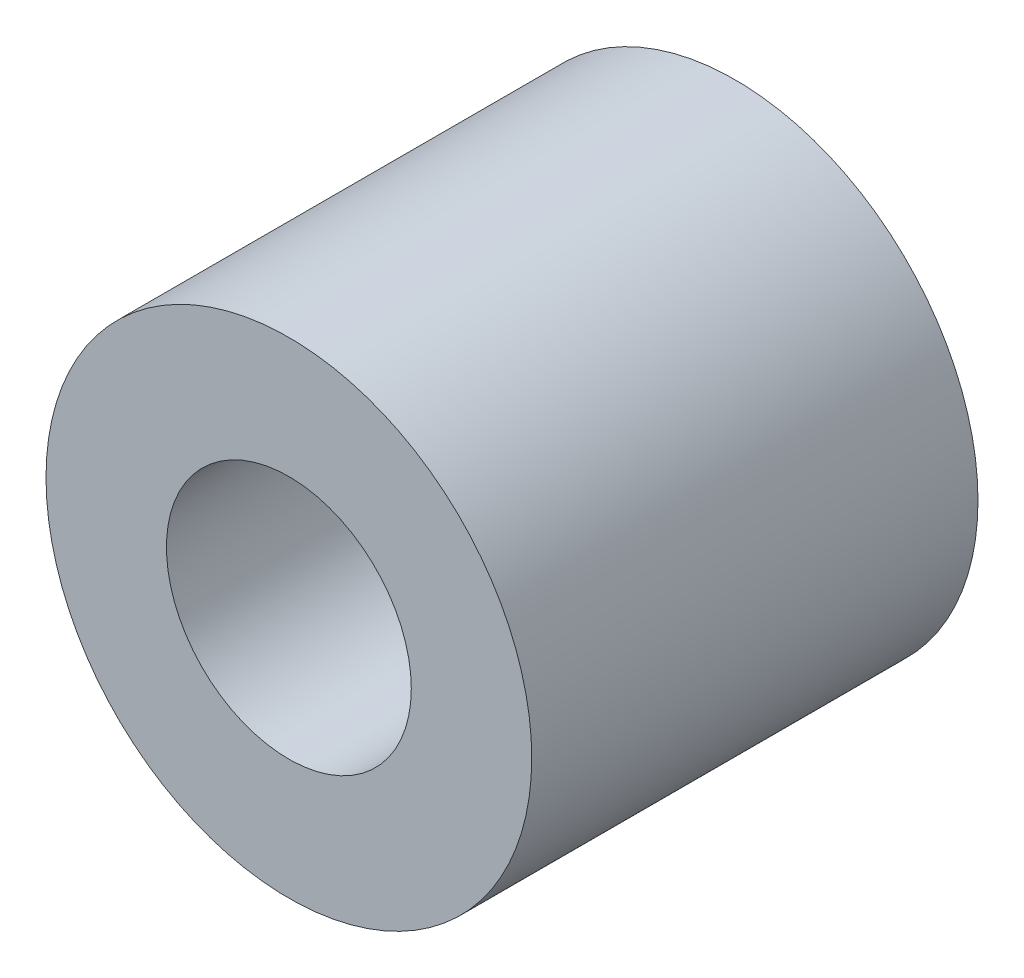
ISO-10303-21;
HEADER;
FILE_DESCRIPTION(('STEP AP214'),'2;1');
FILE_NAME('part.step','',(''),(''),'','','');
FILE_SCHEMA(('AUTOMOTIVE_DESIGN { 1 0 10303 214 1 1 1 1 }'));
ENDSEC;
DATA;
#1=APPLICATION_CONTEXT('core data for automotive mechanical design processes');
#2=APPLICATION_PROTOCOL_DEFINITION('international standard','automotive_design',2000,#1);
#3=PRODUCT_CONTEXT('',#1,'mechanical');
#4=PRODUCT('Part','Part','',(#3));
#5=PRODUCT_RELATED_PRODUCT_CATEGORY('part','',(#4));
#6=PRODUCT_DEFINITION_FORMATION('','',#4);
#7=PRODUCT_DEFINITION_CONTEXT('part definition',#1,'design');
#8=PRODUCT_DEFINITION('design','',#6,#7);
#9=PRODUCT_DEFINITION_SHAPE('','',#8);
#10=(LENGTH_UNIT() NAMED_UNIT(*) SI_UNIT(.MILLI.,.METRE.));
#11=(NAMED_UNIT(*) PLANE_ANGLE_UNIT() SI_UNIT($,.RADIAN.));
#12=(NAMED_UNIT(*) SI_UNIT($,.STERADIAN.) SOLID_ANGLE_UNIT());
#13=UNCERTAINTY_MEASURE_WITH_UNIT(LENGTH_MEASURE(1.E-05),#10,'distance_accuracy_value','');
#14=(GEOMETRIC_REPRESENTATION_CONTEXT(3) GLOBAL_UNCERTAINTY_ASSIGNED_CONTEXT((#13)) GLOBAL_UNIT_ASSIGNED_CONTEXT((#10,
#11,#12)) REPRESENTATION_CONTEXT('',''));
#15=CARTESIAN_POINT('',(0.,0.,0.));
#16=DIRECTION('',(0.,0.,1.));
#17=DIRECTION('',(1.,0.,0.));
#18=AXIS2_PLACEMENT_3D('',#15,#16,#17);
#19=CARTESIAN_POINT('',(0.,0.,5.7404));
#20=DIRECTION('',(0.,0.,1.));
#21=DIRECTION('',(1.,0.,0.));
#22=AXIS2_PLACEMENT_3D('',#19,#20,#21);
#23=PLANE('',#22);
#24=CARTESIAN_POINT('',(0.,0.,5.7404));
#25=DIRECTION('',(0.,0.,1.));
#26=DIRECTION('',(1.,0.,0.));
#27=AXIS2_PLACEMENT_3D('',#24,#25,#26);
#28=CIRCLE('',#27,3.1242);
#29=CARTESIAN_POINT('',(3.1242,0.,5.7404));
#30=VERTEX_POINT('',#29);
#31=EDGE_CURVE('E10',#30,#30,#28,.T.);
#32=ORIENTED_EDGE('',*,*,#31,.T.);
#33=EDGE_LOOP('',(#32));
#34=FACE_BOUND('',#33,.T.);
#35=CARTESIAN_POINT('',(0.,0.,5.7404));
#36=DIRECTION('',(0.,0.,1.));
#37=DIRECTION('',(1.,0.,0.));
#38=AXIS2_PLACEMENT_3D('',#35,#36,#37);
#39=CIRCLE('',#38,1.5748);
#40=CARTESIAN_POINT('',(1.5748,0.,5.7404));
#41=VERTEX_POINT('',#40);
#42=EDGE_CURVE('E44',#41,#41,#39,.T.);
#43=ORIENTED_EDGE('',*,*,#42,.F.);
#44=EDGE_LOOP('',(#43));
#45=FACE_BOUND('',#44,.T.);
#46=ADVANCED_FACE('F33',(#34,#45),#23,.T.);
#47=CARTESIAN_POINT('',(0.,0.,0.));
#48=DIRECTION('',(0.,0.,1.));
#49=DIRECTION('',(1.,0.,0.));
#50=AXIS2_PLACEMENT_3D('',#47,#48,#49);
#51=PLANE('',#50);
#52=CARTESIAN_POINT('',(0.,0.,0.));
#53=DIRECTION('',(0.,0.,1.));
#54=DIRECTION('',(1.,0.,0.));
#55=AXIS2_PLACEMENT_3D('',#52,#53,#54);
#56=CIRCLE('',#55,3.1242);
#57=CARTESIAN_POINT('',(3.1242,0.,0.));
#58=VERTEX_POINT('',#57);
#59=EDGE_CURVE('E37',#58,#58,#56,.T.);
#60=ORIENTED_EDGE('',*,*,#59,.F.);
#61=EDGE_LOOP('',(#60));
#62=FACE_BOUND('',#61,.T.);
#63=CARTESIAN_POINT('',(0.,0.,0.));
#64=DIRECTION('',(0.,0.,1.));
#65=DIRECTION('',(1.,0.,0.));
#66=AXIS2_PLACEMENT_3D('',#63,#64,#65);
#67=CIRCLE('',#66,1.5748);
#68=CARTESIAN_POINT('',(1.5748,0.,0.));
#69=VERTEX_POINT('',#68);
#70=EDGE_CURVE('E46',#69,#69,#67,.T.);
#71=ORIENTED_EDGE('',*,*,#70,.T.);
#72=EDGE_LOOP('',(#71));
#73=FACE_BOUND('',#72,.T.);
#74=ADVANCED_FACE('F56',(#62,#73),#51,.F.);
#75=CARTESIAN_POINT('',(0.,0.,5.7404));
#76=DIRECTION('',(0.,0.,-1.));
#77=DIRECTION('',(-1.,0.,0.));
#78=AXIS2_PLACEMENT_3D('',#75,#76,#77);
#79=CYLINDRICAL_SURFACE('',#78,3.1242);
#80=ORIENTED_EDGE('',*,*,#31,.F.);
#81=EDGE_LOOP('',(#80));
#82=FACE_BOUND('',#81,.T.);
#83=ORIENTED_EDGE('',*,*,#59,.T.);
#84=EDGE_LOOP('',(#83));
#85=FACE_BOUND('',#84,.T.);
#86=ADVANCED_FACE('F35',(#82,#85),#79,.T.);
#87=CARTESIAN_POINT('',(0.,0.,5.7404));
#88=DIRECTION('',(0.,0.,-1.));
#89=DIRECTION('',(-1.,0.,0.));
#90=AXIS2_PLACEMENT_3D('',#87,#88,#89);
#91=CYLINDRICAL_SURFACE('',#90,1.5748);
#92=ORIENTED_EDGE('',*,*,#42,.T.);
#93=EDGE_LOOP('',(#92));
#94=FACE_BOUND('',#93,.T.);
#95=ORIENTED_EDGE('',*,*,#70,.F.);
#96=EDGE_LOOP('',(#95));
#97=FACE_BOUND('',#96,.T.);
#98=ADVANCED_FACE('F52',(#94,#97),#91,.F.);
#99=CLOSED_SHELL('',(#46,#74,#86,#98));
#100=MANIFOLD_SOLID_BREP('B2',#99);
#101=ADVANCED_BREP_SHAPE_REPRESENTATION('',(#18,#100),#14);
#102=SHAPE_DEFINITION_REPRESENTATION(#9,#101);
ENDSEC;
END-ISO-10303-21;
